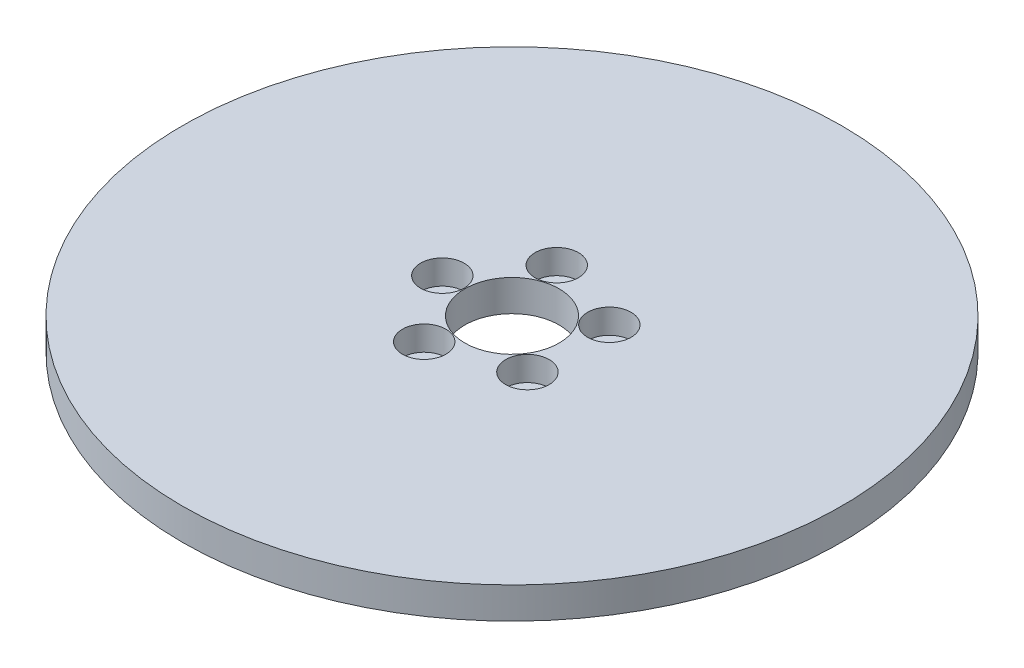
ISO-10303-21;
HEADER;
FILE_DESCRIPTION(('STEP AP214'),'2;1');
FILE_NAME('part.step','',(''),(''),'','','');
FILE_SCHEMA(('AUTOMOTIVE_DESIGN { 1 0 10303 214 1 1 1 1 }'));
ENDSEC;
DATA;
#1=APPLICATION_CONTEXT('core data for automotive mechanical design processes');
#2=APPLICATION_PROTOCOL_DEFINITION('international standard','automotive_design',2000,#1);
#3=PRODUCT_CONTEXT('',#1,'mechanical');
#4=PRODUCT('Part','Part','',(#3));
#5=PRODUCT_RELATED_PRODUCT_CATEGORY('part','',(#4));
#6=PRODUCT_DEFINITION_FORMATION('','',#4);
#7=PRODUCT_DEFINITION_CONTEXT('part definition',#1,'design');
#8=PRODUCT_DEFINITION('design','',#6,#7);
#9=PRODUCT_DEFINITION_SHAPE('','',#8);
#10=(LENGTH_UNIT() NAMED_UNIT(*) SI_UNIT(.MILLI.,.METRE.));
#11=(NAMED_UNIT(*) PLANE_ANGLE_UNIT() SI_UNIT($,.RADIAN.));
#12=(NAMED_UNIT(*) SI_UNIT($,.STERADIAN.) SOLID_ANGLE_UNIT());
#13=UNCERTAINTY_MEASURE_WITH_UNIT(LENGTH_MEASURE(1.E-05),#10,'distance_accuracy_value','');
#14=(GEOMETRIC_REPRESENTATION_CONTEXT(3) GLOBAL_UNCERTAINTY_ASSIGNED_CONTEXT((#13)) GLOBAL_UNIT_ASSIGNED_CONTEXT((#10,
#11,#12)) REPRESENTATION_CONTEXT('',''));
#15=CARTESIAN_POINT('',(0.,0.,0.));
#16=DIRECTION('',(0.,0.,1.));
#17=DIRECTION('',(1.,0.,0.));
#18=AXIS2_PLACEMENT_3D('',#15,#16,#17);
#19=CARTESIAN_POINT('',(0.,5.,0.));
#20=DIRECTION('',(0.,-1.,0.));
#21=DIRECTION('',(0.,0.,-1.));
#22=AXIS2_PLACEMENT_3D('',#19,#20,#21);
#23=CYLINDRICAL_SURFACE('',#22,52.5);
#24=CARTESIAN_POINT('',(0.,5.,0.));
#25=DIRECTION('',(0.,1.,0.));
#26=DIRECTION('',(0.,0.,1.));
#27=AXIS2_PLACEMENT_3D('',#24,#25,#26);
#28=CIRCLE('',#27,52.5);
#29=CARTESIAN_POINT('',(0.,5.,52.5));
#30=VERTEX_POINT('',#29);
#31=EDGE_CURVE('E10',#30,#30,#28,.T.);
#32=ORIENTED_EDGE('',*,*,#31,.F.);
#33=EDGE_LOOP('',(#32));
#34=FACE_BOUND('',#33,.T.);
#35=CARTESIAN_POINT('',(0.,0.,0.));
#36=DIRECTION('',(0.,1.,0.));
#37=DIRECTION('',(0.,0.,1.));
#38=AXIS2_PLACEMENT_3D('',#35,#36,#37);
#39=CIRCLE('',#38,52.5);
#40=CARTESIAN_POINT('',(0.,0.,52.5));
#41=VERTEX_POINT('',#40);
#42=EDGE_CURVE('E37',#41,#41,#39,.T.);
#43=ORIENTED_EDGE('',*,*,#42,.T.);
#44=EDGE_LOOP('',(#43));
#45=FACE_BOUND('',#44,.T.);
#46=ADVANCED_FACE('F40',(#34,#45),#23,.T.);
#47=CARTESIAN_POINT('',(0.,5.,0.));
#48=DIRECTION('',(0.,1.,0.));
#49=DIRECTION('',(0.,0.,1.));
#50=AXIS2_PLACEMENT_3D('',#47,#48,#49);
#51=PLANE('',#50);
#52=CARTESIAN_POINT('',(-3.4306963471404,5.,-10.5585976686409));
#53=DIRECTION('',(0.,1.,0.));
#54=DIRECTION('',(-0.95105651629515,0.,0.309016994374958));
#55=AXIS2_PLACEMENT_3D('',#52,#53,#54);
#56=CIRCLE('',#55,3.46232339071134);
#57=CARTESIAN_POINT('',(-6.72356156939754,5.,-9.48868090088914));
#58=VERTEX_POINT('',#57);
#59=EDGE_CURVE('E70',#58,#58,#56,.T.);
#60=ORIENTED_EDGE('',*,*,#59,.F.);
#61=EDGE_LOOP('',(#60));
#62=FACE_BOUND('',#61,.T.);
#63=CARTESIAN_POINT('',(8.9816796418933,5.,-6.52557223275556));
#64=DIRECTION('',(0.,1.,0.));
#65=DIRECTION('',(-0.58778525229248,0.,-0.809016994374942));
#66=AXIS2_PLACEMENT_3D('',#63,#64,#65);
#67=CIRCLE('',#66,3.46232339071134);
#68=CARTESIAN_POINT('',(6.94657701416588,5.,-9.32665069586291));
#69=VERTEX_POINT('',#68);
#70=EDGE_CURVE('E71',#69,#69,#67,.T.);
#71=ORIENTED_EDGE('',*,*,#70,.F.);
#72=EDGE_LOOP('',(#71));
#73=FACE_BOUND('',#72,.T.);
#74=CARTESIAN_POINT('',(8.9816796418934,5.,6.52557223275543));
#75=DIRECTION('',(0.,1.,0.));
#76=DIRECTION('',(0.587785252292469,0.,-0.809016994374951));
#77=AXIS2_PLACEMENT_3D('',#74,#75,#76);
#78=CIRCLE('',#77,3.46232339071134);
#79=CARTESIAN_POINT('',(11.0167822696208,5.,3.72449376964806));
#80=VERTEX_POINT('',#79);
#81=EDGE_CURVE('E78',#80,#80,#78,.T.);
#82=ORIENTED_EDGE('',*,*,#81,.F.);
#83=EDGE_LOOP('',(#82));
#84=FACE_BOUND('',#83,.T.);
#85=CARTESIAN_POINT('',(-3.43069634714025,5.,10.5585976686409));
#86=DIRECTION('',(0.,1.,0.));
#87=DIRECTION('',(0.951056516295155,0.,0.309016994374945));
#88=AXIS2_PLACEMENT_3D('',#85,#86,#87);
#89=CIRCLE('',#88,3.46232339071134);
#90=CARTESIAN_POINT('',(-0.137831124883098,5.,11.6285144363926));
#91=VERTEX_POINT('',#90);
#92=EDGE_CURVE('E61',#91,#91,#89,.T.);
#93=ORIENTED_EDGE('',*,*,#92,.F.);
#94=EDGE_LOOP('',(#93));
#95=FACE_BOUND('',#94,.T.);
#96=CARTESIAN_POINT('',(-11.1019665895062,5.,0.));
#97=DIRECTION('',(0.,1.,0.));
#98=DIRECTION('',(0.,0.,1.));
#99=AXIS2_PLACEMENT_3D('',#96,#97,#98);
#100=CIRCLE('',#99,3.46232339071134);
#101=CARTESIAN_POINT('',(-11.1019665895062,5.,3.46232339071134));
#102=VERTEX_POINT('',#101);
#103=EDGE_CURVE('E54',#102,#102,#100,.T.);
#104=ORIENTED_EDGE('',*,*,#103,.F.);
#105=EDGE_LOOP('',(#104));
#106=FACE_BOUND('',#105,.T.);
#107=CARTESIAN_POINT('',(0.,5.,0.));
#108=DIRECTION('',(0.,1.,0.));
#109=DIRECTION('',(0.,0.,1.));
#110=AXIS2_PLACEMENT_3D('',#107,#108,#109);
#111=CIRCLE('',#110,7.5);
#112=CARTESIAN_POINT('',(0.,5.,7.5));
#113=VERTEX_POINT('',#112);
#114=EDGE_CURVE('E50',#113,#113,#111,.T.);
#115=ORIENTED_EDGE('',*,*,#114,.F.);
#116=EDGE_LOOP('',(#115));
#117=FACE_BOUND('',#116,.T.);
#118=ORIENTED_EDGE('',*,*,#31,.T.);
#119=EDGE_LOOP('',(#118));
#120=FACE_BOUND('',#119,.T.);
#121=ADVANCED_FACE('F94',(#62,#73,#84,#95,#106,#117,#120),#51,.T.);
#122=CARTESIAN_POINT('',(0.,0.,0.));
#123=DIRECTION('',(0.,1.,0.));
#124=DIRECTION('',(0.,0.,1.));
#125=AXIS2_PLACEMENT_3D('',#122,#123,#124);
#126=PLANE('',#125);
#127=CARTESIAN_POINT('',(0.,0.,0.));
#128=DIRECTION('',(0.,1.,0.));
#129=DIRECTION('',(0.,0.,1.));
#130=AXIS2_PLACEMENT_3D('',#127,#128,#129);
#131=CIRCLE('',#130,7.5);
#132=CARTESIAN_POINT('',(0.,0.,7.5));
#133=VERTEX_POINT('',#132);
#134=EDGE_CURVE('E47',#133,#133,#131,.T.);
#135=ORIENTED_EDGE('',*,*,#134,.T.);
#136=EDGE_LOOP('',(#135));
#137=FACE_BOUND('',#136,.T.);
#138=ORIENTED_EDGE('',*,*,#42,.F.);
#139=EDGE_LOOP('',(#138));
#140=FACE_BOUND('',#139,.T.);
#141=ADVANCED_FACE('F100',(#137,#140),#126,.F.);
#142=CARTESIAN_POINT('',(0.,5.,0.));
#143=DIRECTION('',(0.,-1.,0.));
#144=DIRECTION('',(0.,0.,-1.));
#145=AXIS2_PLACEMENT_3D('',#142,#143,#144);
#146=CYLINDRICAL_SURFACE('',#145,7.5);
#147=ORIENTED_EDGE('',*,*,#114,.T.);
#148=EDGE_LOOP('',(#147));
#149=FACE_BOUND('',#148,.T.);
#150=ORIENTED_EDGE('',*,*,#134,.F.);
#151=EDGE_LOOP('',(#150));
#152=FACE_BOUND('',#151,.T.);
#153=ADVANCED_FACE('F106',(#149,#152),#146,.F.);
#154=CARTESIAN_POINT('',(-11.1019665895062,1.10342508230337,0.));
#155=DIRECTION('',(0.,1.,0.));
#156=DIRECTION('',(0.,0.,1.));
#157=AXIS2_PLACEMENT_3D('',#154,#155,#156);
#158=CYLINDRICAL_SURFACE('',#157,3.46232339071134);
#159=CARTESIAN_POINT('',(-11.1019665895062,1.10342508230337,0.));
#160=DIRECTION('',(0.,1.,0.));
#161=DIRECTION('',(0.,0.,1.));
#162=AXIS2_PLACEMENT_3D('',#159,#160,#161);
#163=CIRCLE('',#162,3.46232339071134);
#164=CARTESIAN_POINT('',(-11.1019665895062,1.10342508230337,3.46232339071134));
#165=VERTEX_POINT('',#164);
#166=EDGE_CURVE('E55',#165,#165,#163,.T.);
#167=ORIENTED_EDGE('',*,*,#166,.F.);
#168=EDGE_LOOP('',(#167));
#169=FACE_BOUND('',#168,.T.);
#170=ORIENTED_EDGE('',*,*,#103,.T.);
#171=EDGE_LOOP('',(#170));
#172=FACE_BOUND('',#171,.T.);
#173=ADVANCED_FACE('F108',(#169,#172),#158,.F.);
#174=CARTESIAN_POINT('',(-11.1019665895062,1.10342508230337,0.));
#175=DIRECTION('',(0.,1.,0.));
#176=DIRECTION('',(0.,0.,1.));
#177=AXIS2_PLACEMENT_3D('',#174,#175,#176);
#178=PLANE('',#177);
#179=ORIENTED_EDGE('',*,*,#166,.T.);
#180=EDGE_LOOP('',(#179));
#181=FACE_BOUND('',#180,.T.);
#182=ADVANCED_FACE('F138',(#181),#178,.T.);
#183=CARTESIAN_POINT('',(-3.43069634714025,1.10342508230337,10.5585976686409));
#184=DIRECTION('',(0.,1.,0.));
#185=DIRECTION('',(0.,0.,1.));
#186=AXIS2_PLACEMENT_3D('',#183,#184,#185);
#187=CYLINDRICAL_SURFACE('',#186,3.46232339071134);
#188=CARTESIAN_POINT('',(-3.43069634714025,1.10342508230337,10.5585976686409));
#189=DIRECTION('',(0.,1.,0.));
#190=DIRECTION('',(0.951056516295155,0.,0.309016994374945));
#191=AXIS2_PLACEMENT_3D('',#188,#189,#190);
#192=CIRCLE('',#191,3.46232339071134);
#193=CARTESIAN_POINT('',(-0.137831124883098,1.10342508230337,11.6285144363926));
#194=VERTEX_POINT('',#193);
#195=EDGE_CURVE('E59',#194,#194,#192,.T.);
#196=ORIENTED_EDGE('',*,*,#195,.F.);
#197=EDGE_LOOP('',(#196));
#198=FACE_BOUND('',#197,.T.);
#199=ORIENTED_EDGE('',*,*,#92,.T.);
#200=EDGE_LOOP('',(#199));
#201=FACE_BOUND('',#200,.T.);
#202=ADVANCED_FACE('F150',(#198,#201),#187,.F.);
#203=CARTESIAN_POINT('',(-3.43069634714025,1.10342508230337,10.5585976686409));
#204=DIRECTION('',(0.,1.,0.));
#205=DIRECTION('',(0.951056516295155,0.,0.309016994374945));
#206=AXIS2_PLACEMENT_3D('',#203,#204,#205);
#207=PLANE('',#206);
#208=ORIENTED_EDGE('',*,*,#195,.T.);
#209=EDGE_LOOP('',(#208));
#210=FACE_BOUND('',#209,.T.);
#211=ADVANCED_FACE('F89',(#210),#207,.T.);
#212=CARTESIAN_POINT('',(8.9816796418934,1.10342508230337,6.52557223275543));
#213=DIRECTION('',(0.,1.,0.));
#214=DIRECTION('',(0.,0.,1.));
#215=AXIS2_PLACEMENT_3D('',#212,#213,#214);
#216=CYLINDRICAL_SURFACE('',#215,3.46232339071134);
#217=CARTESIAN_POINT('',(8.9816796418934,1.10342508230337,6.52557223275543));
#218=DIRECTION('',(0.,1.,0.));
#219=DIRECTION('',(0.587785252292469,0.,-0.809016994374951));
#220=AXIS2_PLACEMENT_3D('',#217,#218,#219);
#221=CIRCLE('',#220,3.46232339071134);
#222=CARTESIAN_POINT('',(11.0167822696208,1.10342508230337,3.72449376964806));
#223=VERTEX_POINT('',#222);
#224=EDGE_CURVE('E63',#223,#223,#221,.T.);
#225=ORIENTED_EDGE('',*,*,#224,.F.);
#226=EDGE_LOOP('',(#225));
#227=FACE_BOUND('',#226,.T.);
#228=ORIENTED_EDGE('',*,*,#81,.T.);
#229=EDGE_LOOP('',(#228));
#230=FACE_BOUND('',#229,.T.);
#231=ADVANCED_FACE('F87',(#227,#230),#216,.F.);
#232=CARTESIAN_POINT('',(8.9816796418934,1.10342508230337,6.52557223275543));
#233=DIRECTION('',(0.,1.,0.));
#234=DIRECTION('',(0.587785252292469,0.,-0.809016994374951));
#235=AXIS2_PLACEMENT_3D('',#232,#233,#234);
#236=PLANE('',#235);
#237=ORIENTED_EDGE('',*,*,#224,.T.);
#238=EDGE_LOOP('',(#237));
#239=FACE_BOUND('',#238,.T.);
#240=ADVANCED_FACE('F84',(#239),#236,.T.);
#241=CARTESIAN_POINT('',(8.9816796418933,1.10342508230337,-6.52557223275556));
#242=DIRECTION('',(0.,1.,0.));
#243=DIRECTION('',(0.,0.,1.));
#244=AXIS2_PLACEMENT_3D('',#241,#242,#243);
#245=CYLINDRICAL_SURFACE('',#244,3.46232339071134);
#246=CARTESIAN_POINT('',(8.9816796418933,1.10342508230337,-6.52557223275556));
#247=DIRECTION('',(0.,1.,0.));
#248=DIRECTION('',(-0.58778525229248,0.,-0.809016994374942));
#249=AXIS2_PLACEMENT_3D('',#246,#247,#248);
#250=CIRCLE('',#249,3.46232339071134);
#251=CARTESIAN_POINT('',(6.94657701416588,1.10342508230337,-9.32665069586291));
#252=VERTEX_POINT('',#251);
#253=EDGE_CURVE('E76',#252,#252,#250,.T.);
#254=ORIENTED_EDGE('',*,*,#253,.F.);
#255=EDGE_LOOP('',(#254));
#256=FACE_BOUND('',#255,.T.);
#257=ORIENTED_EDGE('',*,*,#70,.T.);
#258=EDGE_LOOP('',(#257));
#259=FACE_BOUND('',#258,.T.);
#260=ADVANCED_FACE('F185',(#256,#259),#245,.F.);
#261=CARTESIAN_POINT('',(8.9816796418933,1.10342508230337,-6.52557223275556));
#262=DIRECTION('',(0.,1.,0.));
#263=DIRECTION('',(-0.58778525229248,0.,-0.809016994374942));
#264=AXIS2_PLACEMENT_3D('',#261,#262,#263);
#265=PLANE('',#264);
#266=ORIENTED_EDGE('',*,*,#253,.T.);
#267=EDGE_LOOP('',(#266));
#268=FACE_BOUND('',#267,.T.);
#269=ADVANCED_FACE('F189',(#268),#265,.T.);
#270=CARTESIAN_POINT('',(-3.4306963471404,1.10342508230337,-10.5585976686409));
#271=DIRECTION('',(0.,1.,0.));
#272=DIRECTION('',(0.,0.,1.));
#273=AXIS2_PLACEMENT_3D('',#270,#271,#272);
#274=CYLINDRICAL_SURFACE('',#273,3.46232339071134);
#275=CARTESIAN_POINT('',(-3.4306963471404,1.10342508230337,-10.5585976686409));
#276=DIRECTION('',(0.,1.,0.));
#277=DIRECTION('',(-0.95105651629515,0.,0.309016994374958));
#278=AXIS2_PLACEMENT_3D('',#275,#276,#277);
#279=CIRCLE('',#278,3.46232339071134);
#280=CARTESIAN_POINT('',(-6.72356156939754,1.10342508230337,-9.48868090088914));
#281=VERTEX_POINT('',#280);
#282=EDGE_CURVE('E69',#281,#281,#279,.T.);
#283=ORIENTED_EDGE('',*,*,#282,.F.);
#284=EDGE_LOOP('',(#283));
#285=FACE_BOUND('',#284,.T.);
#286=ORIENTED_EDGE('',*,*,#59,.T.);
#287=EDGE_LOOP('',(#286));
#288=FACE_BOUND('',#287,.T.);
#289=ADVANCED_FACE('F200',(#285,#288),#274,.F.);
#290=CARTESIAN_POINT('',(-3.4306963471404,1.10342508230337,-10.5585976686409));
#291=DIRECTION('',(0.,1.,0.));
#292=DIRECTION('',(-0.95105651629515,0.,0.309016994374958));
#293=AXIS2_PLACEMENT_3D('',#290,#291,#292);
#294=PLANE('',#293);
#295=ORIENTED_EDGE('',*,*,#282,.T.);
#296=EDGE_LOOP('',(#295));
#297=FACE_BOUND('',#296,.T.);
#298=ADVANCED_FACE('F208',(#297),#294,.T.);
#299=CLOSED_SHELL('',(#46,#121,#141,#153,#173,#182,#202,#211,#231,#240,#260,#269,#289,#298));
#300=MANIFOLD_SOLID_BREP('B2',#299);
#301=ADVANCED_BREP_SHAPE_REPRESENTATION('',(#18,#300),#14);
#302=SHAPE_DEFINITION_REPRESENTATION(#9,#301);
ENDSEC;
END-ISO-10303-21;
